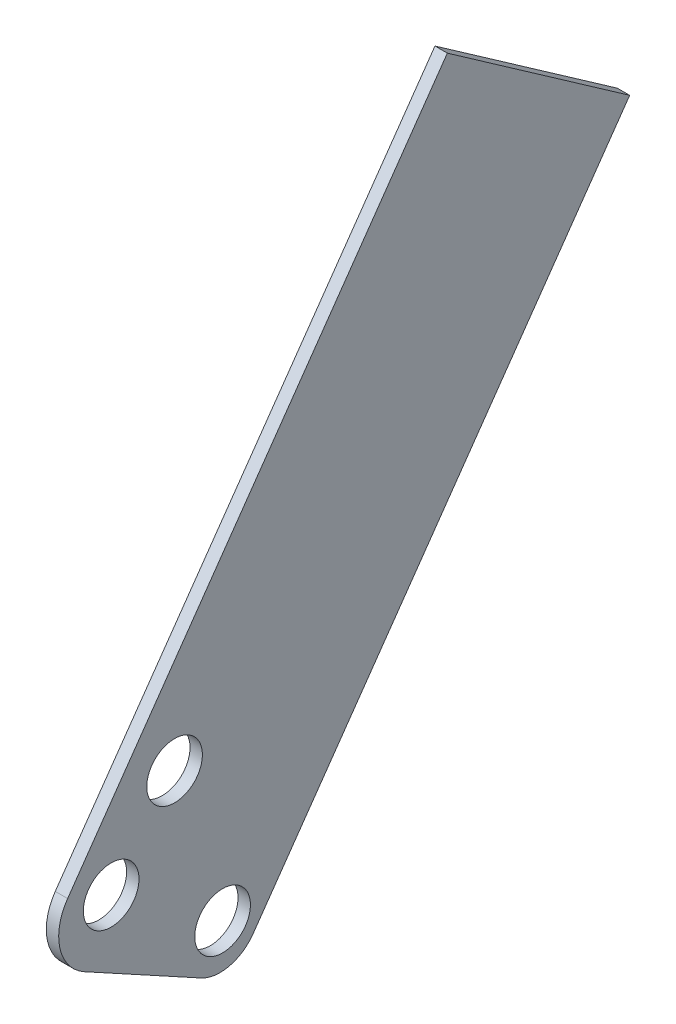
ISO-10303-21;
HEADER;
FILE_DESCRIPTION(('STEP AP214'),'2;1');
FILE_NAME('part.step','',(''),(''),'','','');
FILE_SCHEMA(('AUTOMOTIVE_DESIGN { 1 0 10303 214 1 1 1 1 }'));
ENDSEC;
DATA;
#1=APPLICATION_CONTEXT('core data for automotive mechanical design processes');
#2=APPLICATION_PROTOCOL_DEFINITION('international standard','automotive_design',2000,#1);
#3=PRODUCT_CONTEXT('',#1,'mechanical');
#4=PRODUCT('Part','Part','',(#3));
#5=PRODUCT_RELATED_PRODUCT_CATEGORY('part','',(#4));
#6=PRODUCT_DEFINITION_FORMATION('','',#4);
#7=PRODUCT_DEFINITION_CONTEXT('part definition',#1,'design');
#8=PRODUCT_DEFINITION('design','',#6,#7);
#9=PRODUCT_DEFINITION_SHAPE('','',#8);
#10=(LENGTH_UNIT() NAMED_UNIT(*) SI_UNIT(.MILLI.,.METRE.));
#11=(NAMED_UNIT(*) PLANE_ANGLE_UNIT() SI_UNIT($,.RADIAN.));
#12=(NAMED_UNIT(*) SI_UNIT($,.STERADIAN.) SOLID_ANGLE_UNIT());
#13=UNCERTAINTY_MEASURE_WITH_UNIT(LENGTH_MEASURE(1.E-05),#10,'distance_accuracy_value','');
#14=(GEOMETRIC_REPRESENTATION_CONTEXT(3) GLOBAL_UNCERTAINTY_ASSIGNED_CONTEXT((#13)) GLOBAL_UNIT_ASSIGNED_CONTEXT((#10,
#11,#12)) REPRESENTATION_CONTEXT('',''));
#15=CARTESIAN_POINT('',(0.,0.,0.));
#16=DIRECTION('',(0.,0.,1.));
#17=DIRECTION('',(1.,0.,0.));
#18=AXIS2_PLACEMENT_3D('',#15,#16,#17);
#19=CARTESIAN_POINT('',(-3.175,356.85025362409,-110.334702104202));
#20=DIRECTION('',(0.,0.819152044288989,-0.57357643635105));
#21=DIRECTION('',(0.,0.57357643635105,0.819152044288989));
#22=AXIS2_PLACEMENT_3D('',#19,#20,#21);
#23=PLANE('',#22);
#24=DIRECTION('',(1.,0.,0.));
#25=VECTOR('',#24,1.);
#26=CARTESIAN_POINT('',(-3.175,356.85025362409,-110.334702104202));
#27=LINE('',#26,#25);
#28=CARTESIAN_POINT('',(-3.175,356.85025362409,-110.334702104202));
#29=VERTEX_POINT('',#28);
#30=CARTESIAN_POINT('',(3.175,356.85025362409,-110.334702104202));
#31=VERTEX_POINT('',#30);
#32=EDGE_CURVE('E45',#29,#31,#27,.T.);
#33=ORIENTED_EDGE('',*,*,#32,.T.);
#34=DIRECTION('',(0.,0.57357643635105,0.819152044288989));
#35=VECTOR('',#34,1.);
#36=CARTESIAN_POINT('',(3.175,356.85025362409,-110.334702104202));
#37=LINE('',#36,#35);
#38=CARTESIAN_POINT('',(3.175,291.290466949165,-203.963780766433));
#39=VERTEX_POINT('',#38);
#40=EDGE_CURVE('E95',#39,#31,#37,.T.);
#41=ORIENTED_EDGE('',*,*,#40,.F.);
#42=DIRECTION('',(1.,0.,0.));
#43=VECTOR('',#42,1.);
#44=CARTESIAN_POINT('',(-3.175,291.290466949165,-203.963780766433));
#45=LINE('',#44,#43);
#46=CARTESIAN_POINT('',(-3.175,291.290466949165,-203.963780766433));
#47=VERTEX_POINT('',#46);
#48=EDGE_CURVE('E11',#47,#39,#45,.T.);
#49=ORIENTED_EDGE('',*,*,#48,.F.);
#50=DIRECTION('',(0.,0.57357643635105,0.819152044288989));
#51=VECTOR('',#50,1.);
#52=CARTESIAN_POINT('',(-3.175,356.85025362409,-110.334702104202));
#53=LINE('',#52,#51);
#54=EDGE_CURVE('E96',#47,#29,#53,.T.);
#55=ORIENTED_EDGE('',*,*,#54,.T.);
#56=EDGE_LOOP('',(#33,#41,#49,#55));
#57=FACE_BOUND('',#56,.T.);
#58=ADVANCED_FACE('F42',(#57),#23,.T.);
#59=CARTESIAN_POINT('',(-3.175,15.1309224595558,-10.5947859662477));
#60=DIRECTION('',(0.,-0.57357643635105,-0.819152044288989));
#61=DIRECTION('',(0.,0.819152044288989,-0.57357643635105));
#62=AXIS2_PLACEMENT_3D('',#59,#60,#61);
#63=PLANE('',#62);
#64=ORIENTED_EDGE('',*,*,#48,.T.);
#65=DIRECTION('',(0.,0.819152044288989,-0.57357643635105));
#66=VECTOR('',#65,1.);
#67=CARTESIAN_POINT('',(3.175,15.1309224595558,-10.5947859662477));
#68=LINE('',#67,#66);
#69=CARTESIAN_POINT('',(3.175,15.1309224595558,-10.5947859662477));
#70=VERTEX_POINT('',#69);
#71=EDGE_CURVE('E116',#70,#39,#68,.T.);
#72=ORIENTED_EDGE('',*,*,#71,.F.);
#73=DIRECTION('',(1.,0.,0.));
#74=VECTOR('',#73,1.);
#75=CARTESIAN_POINT('',(-3.175,15.1309224595558,-10.5947859662477));
#76=LINE('',#75,#74);
#77=CARTESIAN_POINT('',(-3.175,15.1309224595558,-10.5947859662477));
#78=VERTEX_POINT('',#77);
#79=EDGE_CURVE('E51',#78,#70,#76,.T.);
#80=ORIENTED_EDGE('',*,*,#79,.F.);
#81=DIRECTION('',(0.,0.819152044288989,-0.57357643635105));
#82=VECTOR('',#81,1.);
#83=CARTESIAN_POINT('',(-3.175,15.1309224595558,-10.5947859662477));
#84=LINE('',#83,#82);
#85=EDGE_CURVE('E102',#78,#47,#84,.T.);
#86=ORIENTED_EDGE('',*,*,#85,.T.);
#87=EDGE_LOOP('',(#64,#72,#80,#86));
#88=FACE_BOUND('',#87,.T.);
#89=ADVANCED_FACE('F189',(#88),#63,.T.);
#90=CARTESIAN_POINT('',(-3.175,26.9681061647505,6.31046434776639));
#91=DIRECTION('',(1.,0.,0.));
#92=DIRECTION('',(0.,0.,-1.));
#93=AXIS2_PLACEMENT_3D('',#90,#91,#92);
#94=CYLINDRICAL_SURFACE('',#93,20.6375);
#95=ORIENTED_EDGE('',*,*,#79,.T.);
#96=CARTESIAN_POINT('',(3.175,26.9681061647505,6.31046434776639));
#97=DIRECTION('',(1.,0.,0.));
#98=DIRECTION('',(0.,0.,1.));
#99=AXIS2_PLACEMENT_3D('',#96,#97,#98);
#100=CIRCLE('',#99,20.6375);
#101=CARTESIAN_POINT('',(3.175,8.85905458607298,16.2083761058494));
#102=VERTEX_POINT('',#101);
#103=EDGE_CURVE('E132',#102,#70,#100,.T.);
#104=ORIENTED_EDGE('',*,*,#103,.F.);
#105=DIRECTION('',(1.,0.,0.));
#106=VECTOR('',#105,1.);
#107=CARTESIAN_POINT('',(-3.175,8.85905458607298,16.2083761058494));
#108=LINE('',#107,#106);
#109=CARTESIAN_POINT('',(-3.175,8.85905458607298,16.2083761058494));
#110=VERTEX_POINT('',#109);
#111=EDGE_CURVE('E169',#110,#102,#108,.T.);
#112=ORIENTED_EDGE('',*,*,#111,.F.);
#113=CARTESIAN_POINT('',(-3.175,26.9681061647505,6.31046434776639));
#114=DIRECTION('',(1.,0.,0.));
#115=DIRECTION('',(0.,0.,1.));
#116=AXIS2_PLACEMENT_3D('',#113,#114,#115);
#117=CIRCLE('',#116,20.6375);
#118=EDGE_CURVE('E162',#110,#78,#117,.T.);
#119=ORIENTED_EDGE('',*,*,#118,.T.);
#120=EDGE_LOOP('',(#95,#104,#112,#119));
#121=FACE_BOUND('',#120,.T.);
#122=ADVANCED_FACE('F185',(#121),#94,.T.);
#123=CARTESIAN_POINT('',(-3.175,41.5459827496073,76.0118258161975));
#124=DIRECTION('',(0.,-0.877482814230289,0.479608080343204));
#125=DIRECTION('',(0.,-0.479608080343204,-0.877482814230289));
#126=AXIS2_PLACEMENT_3D('',#123,#124,#125);
#127=PLANE('',#126);
#128=ORIENTED_EDGE('',*,*,#111,.T.);
#129=DIRECTION('',(0.,-0.479608080343204,-0.877482814230289));
#130=VECTOR('',#129,1.);
#131=CARTESIAN_POINT('',(3.175,41.5459827496073,76.0118258161975));
#132=LINE('',#131,#130);
#133=CARTESIAN_POINT('',(3.175,41.5459827496073,76.0118258161975));
#134=VERTEX_POINT('',#133);
#135=EDGE_CURVE('E128',#134,#102,#132,.T.);
#136=ORIENTED_EDGE('',*,*,#135,.F.);
#137=DIRECTION('',(1.,0.,0.));
#138=VECTOR('',#137,1.);
#139=CARTESIAN_POINT('',(-3.175,41.5459827496073,76.0118258161975));
#140=LINE('',#139,#138);
#141=CARTESIAN_POINT('',(-3.175,41.5459827496073,76.0118258161975));
#142=VERTEX_POINT('',#141);
#143=EDGE_CURVE('E172',#142,#134,#140,.T.);
#144=ORIENTED_EDGE('',*,*,#143,.F.);
#145=DIRECTION('',(0.,-0.479608080343204,-0.877482814230289));
#146=VECTOR('',#145,1.);
#147=CARTESIAN_POINT('',(-3.175,41.5459827496073,76.0118258161975));
#148=LINE('',#147,#146);
#149=EDGE_CURVE('E158',#142,#110,#148,.T.);
#150=ORIENTED_EDGE('',*,*,#149,.T.);
#151=EDGE_LOOP('',(#128,#136,#144,#150));
#152=FACE_BOUND('',#151,.T.);
#153=ADVANCED_FACE('F182',(#152),#127,.T.);
#154=CARTESIAN_POINT('',(-3.175,63.8340462310567,63.8297805754802));
#155=DIRECTION('',(1.,0.,0.));
#156=DIRECTION('',(0.,0.,-1.));
#157=AXIS2_PLACEMENT_3D('',#154,#155,#156);
#158=CYLINDRICAL_SURFACE('',#157,25.4);
#159=ORIENTED_EDGE('',*,*,#143,.T.);
#160=CARTESIAN_POINT('',(3.175,63.8340462310567,63.8297805754802));
#161=DIRECTION('',(1.,0.,0.));
#162=DIRECTION('',(0.,0.,1.));
#163=AXIS2_PLACEMENT_3D('',#160,#161,#162);
#164=CIRCLE('',#163,25.4);
#165=CARTESIAN_POINT('',(3.175,78.4028877143736,84.6362425004205));
#166=VERTEX_POINT('',#165);
#167=EDGE_CURVE('E110',#166,#134,#164,.T.);
#168=ORIENTED_EDGE('',*,*,#167,.F.);
#169=DIRECTION('',(1.,0.,0.));
#170=VECTOR('',#169,1.);
#171=CARTESIAN_POINT('',(-3.175,78.4028877143736,84.6362425004205));
#172=LINE('',#171,#170);
#173=CARTESIAN_POINT('',(-3.175,78.4028877143736,84.6362425004205));
#174=VERTEX_POINT('',#173);
#175=EDGE_CURVE('E101',#174,#166,#172,.T.);
#176=ORIENTED_EDGE('',*,*,#175,.F.);
#177=CARTESIAN_POINT('',(-3.175,63.8340462310567,63.8297805754802));
#178=DIRECTION('',(1.,0.,0.));
#179=DIRECTION('',(0.,0.,1.));
#180=AXIS2_PLACEMENT_3D('',#177,#178,#179);
#181=CIRCLE('',#180,25.4);
#182=EDGE_CURVE('E154',#174,#142,#181,.T.);
#183=ORIENTED_EDGE('',*,*,#182,.T.);
#184=EDGE_LOOP('',(#159,#168,#176,#183));
#185=FACE_BOUND('',#184,.T.);
#186=ADVANCED_FACE('F176',(#185),#158,.T.);
#187=CARTESIAN_POINT('',(-3.175,356.85025362409,-110.334702104202));
#188=DIRECTION('',(0.,0.57357643635105,0.819152044288989));
#189=DIRECTION('',(0.,-0.819152044288989,0.57357643635105));
#190=AXIS2_PLACEMENT_3D('',#187,#188,#189);
#191=PLANE('',#190);
#192=ORIENTED_EDGE('',*,*,#175,.T.);
#193=DIRECTION('',(0.,-0.819152044288989,0.57357643635105));
#194=VECTOR('',#193,1.);
#195=CARTESIAN_POINT('',(3.175,356.85025362409,-110.334702104202));
#196=LINE('',#195,#194);
#197=EDGE_CURVE('E104',#31,#166,#196,.T.);
#198=ORIENTED_EDGE('',*,*,#197,.F.);
#199=ORIENTED_EDGE('',*,*,#32,.F.);
#200=DIRECTION('',(0.,-0.819152044288989,0.57357643635105));
#201=VECTOR('',#200,1.);
#202=CARTESIAN_POINT('',(-3.175,356.85025362409,-110.334702104202));
#203=LINE('',#202,#201);
#204=EDGE_CURVE('E151',#29,#174,#203,.T.);
#205=ORIENTED_EDGE('',*,*,#204,.T.);
#206=EDGE_LOOP('',(#192,#198,#199,#205));
#207=FACE_BOUND('',#206,.T.);
#208=ADVANCED_FACE('F105',(#207),#191,.T.);
#209=CARTESIAN_POINT('',(-3.175,26.9681061647505,6.31046434776639));
#210=DIRECTION('',(-1.,0.,0.));
#211=DIRECTION('',(0.,0.,1.));
#212=AXIS2_PLACEMENT_3D('',#209,#210,#211);
#213=PLANE('',#212);
#214=CARTESIAN_POINT('',(-3.175,107.792666854239,29.7168618071148));
#215=DIRECTION('',(1.,0.,0.));
#216=DIRECTION('',(0.,0.,-1.));
#217=AXIS2_PLACEMENT_3D('',#214,#215,#216);
#218=CIRCLE('',#217,14.2875);
#219=CARTESIAN_POINT('',(-3.175,107.792666854239,15.4293618071148));
#220=VERTEX_POINT('',#219);
#221=EDGE_CURVE('E137',#220,#220,#218,.T.);
#222=ORIENTED_EDGE('',*,*,#221,.T.);
#223=EDGE_LOOP('',(#222));
#224=FACE_BOUND('',#223,.T.);
#225=CARTESIAN_POINT('',(-3.175,28.7424340192088,5.06806660881921));
#226=DIRECTION('',(1.,0.,0.));
#227=DIRECTION('',(0.,0.,-1.));
#228=AXIS2_PLACEMENT_3D('',#225,#226,#227);
#229=CIRCLE('',#228,14.2875);
#230=CARTESIAN_POINT('',(-3.175,28.7424340192088,-9.21943339118079));
#231=VERTEX_POINT('',#230);
#232=EDGE_CURVE('E141',#231,#231,#229,.T.);
#233=ORIENTED_EDGE('',*,*,#232,.T.);
#234=EDGE_LOOP('',(#233));
#235=FACE_BOUND('',#234,.T.);
#236=CARTESIAN_POINT('',(-3.175,68.8067480983296,62.2858369024051));
#237=DIRECTION('',(1.,0.,0.));
#238=DIRECTION('',(0.,0.,-1.));
#239=AXIS2_PLACEMENT_3D('',#236,#237,#238);
#240=CIRCLE('',#239,14.2875);
#241=CARTESIAN_POINT('',(-3.175,68.8067480983296,47.9983369024051));
#242=VERTEX_POINT('',#241);
#243=EDGE_CURVE('E145',#242,#242,#240,.T.);
#244=ORIENTED_EDGE('',*,*,#243,.T.);
#245=EDGE_LOOP('',(#244));
#246=FACE_BOUND('',#245,.T.);
#247=ORIENTED_EDGE('',*,*,#54,.F.);
#248=ORIENTED_EDGE('',*,*,#85,.F.);
#249=ORIENTED_EDGE('',*,*,#118,.F.);
#250=ORIENTED_EDGE('',*,*,#149,.F.);
#251=ORIENTED_EDGE('',*,*,#182,.F.);
#252=ORIENTED_EDGE('',*,*,#204,.F.);
#253=EDGE_LOOP('',(#247,#248,#249,#250,#251,#252));
#254=FACE_BOUND('',#253,.T.);
#255=ADVANCED_FACE('F188',(#224,#235,#246,#254),#213,.T.);
#256=CARTESIAN_POINT('',(-3.175,68.8067480983296,62.2858369024051));
#257=DIRECTION('',(1.,0.,0.));
#258=DIRECTION('',(0.,0.,-1.));
#259=AXIS2_PLACEMENT_3D('',#256,#257,#258);
#260=CYLINDRICAL_SURFACE('',#259,14.2875);
#261=ORIENTED_EDGE('',*,*,#243,.F.);
#262=EDGE_LOOP('',(#261));
#263=FACE_BOUND('',#262,.T.);
#264=CARTESIAN_POINT('',(3.175,68.8067480983296,62.2858369024051));
#265=DIRECTION('',(1.,0.,0.));
#266=DIRECTION('',(0.,0.,-1.));
#267=AXIS2_PLACEMENT_3D('',#264,#265,#266);
#268=CIRCLE('',#267,14.2875);
#269=CARTESIAN_POINT('',(3.175,68.8067480983296,47.9983369024051));
#270=VERTEX_POINT('',#269);
#271=EDGE_CURVE('E118',#270,#270,#268,.T.);
#272=ORIENTED_EDGE('',*,*,#271,.T.);
#273=EDGE_LOOP('',(#272));
#274=FACE_BOUND('',#273,.T.);
#275=ADVANCED_FACE('F207',(#263,#274),#260,.F.);
#276=CARTESIAN_POINT('',(-3.175,28.7424340192088,5.06806660881921));
#277=DIRECTION('',(1.,0.,0.));
#278=DIRECTION('',(0.,0.,-1.));
#279=AXIS2_PLACEMENT_3D('',#276,#277,#278);
#280=CYLINDRICAL_SURFACE('',#279,14.2875);
#281=ORIENTED_EDGE('',*,*,#232,.F.);
#282=EDGE_LOOP('',(#281));
#283=FACE_BOUND('',#282,.T.);
#284=CARTESIAN_POINT('',(3.175,28.7424340192088,5.06806660881921));
#285=DIRECTION('',(1.,0.,0.));
#286=DIRECTION('',(0.,0.,-1.));
#287=AXIS2_PLACEMENT_3D('',#284,#285,#286);
#288=CIRCLE('',#287,14.2875);
#289=CARTESIAN_POINT('',(3.175,28.7424340192088,-9.21943339118079));
#290=VERTEX_POINT('',#289);
#291=EDGE_CURVE('E122',#290,#290,#288,.T.);
#292=ORIENTED_EDGE('',*,*,#291,.T.);
#293=EDGE_LOOP('',(#292));
#294=FACE_BOUND('',#293,.T.);
#295=ADVANCED_FACE('F212',(#283,#294),#280,.F.);
#296=CARTESIAN_POINT('',(-3.175,107.792666854239,29.7168618071148));
#297=DIRECTION('',(1.,0.,0.));
#298=DIRECTION('',(0.,0.,-1.));
#299=AXIS2_PLACEMENT_3D('',#296,#297,#298);
#300=CYLINDRICAL_SURFACE('',#299,14.2875);
#301=ORIENTED_EDGE('',*,*,#221,.F.);
#302=EDGE_LOOP('',(#301));
#303=FACE_BOUND('',#302,.T.);
#304=CARTESIAN_POINT('',(3.175,107.792666854239,29.7168618071148));
#305=DIRECTION('',(1.,0.,0.));
#306=DIRECTION('',(0.,0.,-1.));
#307=AXIS2_PLACEMENT_3D('',#304,#305,#306);
#308=CIRCLE('',#307,14.2875);
#309=CARTESIAN_POINT('',(3.175,107.792666854239,15.4293618071148));
#310=VERTEX_POINT('',#309);
#311=EDGE_CURVE('E230',#310,#310,#308,.T.);
#312=ORIENTED_EDGE('',*,*,#311,.T.);
#313=EDGE_LOOP('',(#312));
#314=FACE_BOUND('',#313,.T.);
#315=ADVANCED_FACE('F223',(#303,#314),#300,.F.);
#316=CARTESIAN_POINT('',(3.175,26.9681061647505,6.31046434776639));
#317=DIRECTION('',(-1.,0.,0.));
#318=DIRECTION('',(0.,0.,1.));
#319=AXIS2_PLACEMENT_3D('',#316,#317,#318);
#320=PLANE('',#319);
#321=ORIENTED_EDGE('',*,*,#40,.T.);
#322=ORIENTED_EDGE('',*,*,#197,.T.);
#323=ORIENTED_EDGE('',*,*,#167,.T.);
#324=ORIENTED_EDGE('',*,*,#135,.T.);
#325=ORIENTED_EDGE('',*,*,#103,.T.);
#326=ORIENTED_EDGE('',*,*,#71,.T.);
#327=EDGE_LOOP('',(#321,#322,#323,#324,#325,#326));
#328=FACE_BOUND('',#327,.T.);
#329=ORIENTED_EDGE('',*,*,#271,.F.);
#330=EDGE_LOOP('',(#329));
#331=FACE_BOUND('',#330,.T.);
#332=ORIENTED_EDGE('',*,*,#291,.F.);
#333=EDGE_LOOP('',(#332));
#334=FACE_BOUND('',#333,.T.);
#335=ORIENTED_EDGE('',*,*,#311,.F.);
#336=EDGE_LOOP('',(#335));
#337=FACE_BOUND('',#336,.T.);
#338=ADVANCED_FACE('F113',(#328,#331,#334,#337),#320,.F.);
#339=CLOSED_SHELL('',(#58,#89,#122,#153,#186,#208,#255,#275,#295,#315,#338));
#340=MANIFOLD_SOLID_BREP('B2',#339);
#341=ADVANCED_BREP_SHAPE_REPRESENTATION('',(#18,#340),#14);
#342=SHAPE_DEFINITION_REPRESENTATION(#9,#341);
ENDSEC;
END-ISO-10303-21;
